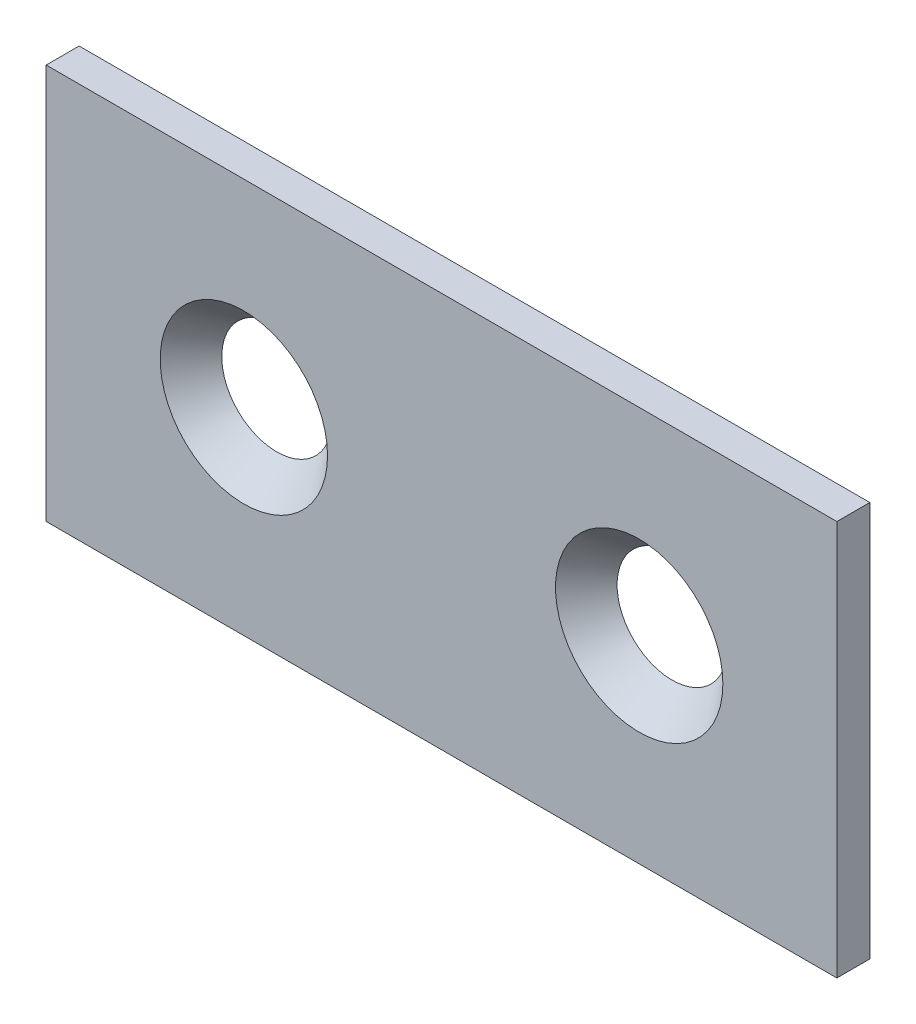
ISO-10303-21;
HEADER;
FILE_DESCRIPTION(('STEP AP214'),'2;1');
FILE_NAME('part.step','',(''),(''),'','','');
FILE_SCHEMA(('AUTOMOTIVE_DESIGN { 1 0 10303 214 1 1 1 1 }'));
ENDSEC;
DATA;
#1=APPLICATION_CONTEXT('core data for automotive mechanical design processes');
#2=APPLICATION_PROTOCOL_DEFINITION('international standard','automotive_design',2000,#1);
#3=PRODUCT_CONTEXT('',#1,'mechanical');
#4=PRODUCT('Part','Part','',(#3));
#5=PRODUCT_RELATED_PRODUCT_CATEGORY('part','',(#4));
#6=PRODUCT_DEFINITION_FORMATION('','',#4);
#7=PRODUCT_DEFINITION_CONTEXT('part definition',#1,'design');
#8=PRODUCT_DEFINITION('design','',#6,#7);
#9=PRODUCT_DEFINITION_SHAPE('','',#8);
#10=(LENGTH_UNIT() NAMED_UNIT(*) SI_UNIT(.MILLI.,.METRE.));
#11=(NAMED_UNIT(*) PLANE_ANGLE_UNIT() SI_UNIT($,.RADIAN.));
#12=(NAMED_UNIT(*) SI_UNIT($,.STERADIAN.) SOLID_ANGLE_UNIT());
#13=UNCERTAINTY_MEASURE_WITH_UNIT(LENGTH_MEASURE(1.E-05),#10,'distance_accuracy_value','');
#14=(GEOMETRIC_REPRESENTATION_CONTEXT(3) GLOBAL_UNCERTAINTY_ASSIGNED_CONTEXT((#13)) GLOBAL_UNIT_ASSIGNED_CONTEXT((#10,
#11,#12)) REPRESENTATION_CONTEXT('',''));
#15=CARTESIAN_POINT('',(0.,0.,0.));
#16=DIRECTION('',(0.,0.,1.));
#17=DIRECTION('',(1.,0.,0.));
#18=AXIS2_PLACEMENT_3D('',#15,#16,#17);
#19=CARTESIAN_POINT('',(38.1,19.05,-3.175));
#20=DIRECTION('',(1.,0.,0.));
#21=DIRECTION('',(0.,0.,-1.));
#22=AXIS2_PLACEMENT_3D('',#19,#20,#21);
#23=PLANE('',#22);
#24=DIRECTION('',(0.,1.,0.));
#25=VECTOR('',#24,1.);
#26=CARTESIAN_POINT('',(38.1,19.05,0.));
#27=LINE('',#26,#25);
#28=CARTESIAN_POINT('',(38.1,-19.05,0.));
#29=VERTEX_POINT('',#28);
#30=CARTESIAN_POINT('',(38.1,19.05,0.));
#31=VERTEX_POINT('',#30);
#32=EDGE_CURVE('E100',#29,#31,#27,.T.);
#33=ORIENTED_EDGE('',*,*,#32,.F.);
#34=DIRECTION('',(0.,0.,1.));
#35=VECTOR('',#34,1.);
#36=CARTESIAN_POINT('',(38.1,-19.05,-3.175));
#37=LINE('',#36,#35);
#38=CARTESIAN_POINT('',(38.1,-19.05,-3.175));
#39=VERTEX_POINT('',#38);
#40=EDGE_CURVE('E11',#39,#29,#37,.T.);
#41=ORIENTED_EDGE('',*,*,#40,.F.);
#42=DIRECTION('',(0.,1.,0.));
#43=VECTOR('',#42,1.);
#44=CARTESIAN_POINT('',(38.1,19.05,-3.175));
#45=LINE('',#44,#43);
#46=CARTESIAN_POINT('',(38.1,19.05,-3.175));
#47=VERTEX_POINT('',#46);
#48=EDGE_CURVE('E93',#39,#47,#45,.T.);
#49=ORIENTED_EDGE('',*,*,#48,.T.);
#50=DIRECTION('',(0.,0.,1.));
#51=VECTOR('',#50,1.);
#52=CARTESIAN_POINT('',(38.1,19.05,-3.175));
#53=LINE('',#52,#51);
#54=EDGE_CURVE('E38',#47,#31,#53,.T.);
#55=ORIENTED_EDGE('',*,*,#54,.T.);
#56=EDGE_LOOP('',(#33,#41,#49,#55));
#57=FACE_BOUND('',#56,.T.);
#58=ADVANCED_FACE('F35',(#57),#23,.T.);
#59=CARTESIAN_POINT('',(-38.1,-19.05,-3.175));
#60=DIRECTION('',(0.,-1.,0.));
#61=DIRECTION('',(1.,0.,0.));
#62=AXIS2_PLACEMENT_3D('',#59,#60,#61);
#63=PLANE('',#62);
#64=DIRECTION('',(1.,0.,0.));
#65=VECTOR('',#64,1.);
#66=CARTESIAN_POINT('',(-38.1,-19.05,0.));
#67=LINE('',#66,#65);
#68=CARTESIAN_POINT('',(-38.1,-19.05,0.));
#69=VERTEX_POINT('',#68);
#70=EDGE_CURVE('E95',#69,#29,#67,.T.);
#71=ORIENTED_EDGE('',*,*,#70,.F.);
#72=DIRECTION('',(0.,0.,1.));
#73=VECTOR('',#72,1.);
#74=CARTESIAN_POINT('',(-38.1,-19.05,-3.175));
#75=LINE('',#74,#73);
#76=CARTESIAN_POINT('',(-38.1,-19.05,-3.175));
#77=VERTEX_POINT('',#76);
#78=EDGE_CURVE('E44',#77,#69,#75,.T.);
#79=ORIENTED_EDGE('',*,*,#78,.F.);
#80=DIRECTION('',(1.,0.,0.));
#81=VECTOR('',#80,1.);
#82=CARTESIAN_POINT('',(-38.1,-19.05,-3.175));
#83=LINE('',#82,#81);
#84=EDGE_CURVE('E90',#77,#39,#83,.T.);
#85=ORIENTED_EDGE('',*,*,#84,.T.);
#86=ORIENTED_EDGE('',*,*,#40,.T.);
#87=EDGE_LOOP('',(#71,#79,#85,#86));
#88=FACE_BOUND('',#87,.T.);
#89=ADVANCED_FACE('F111',(#88),#63,.T.);
#90=CARTESIAN_POINT('',(-38.1,19.05,-3.175));
#91=DIRECTION('',(-1.,0.,0.));
#92=DIRECTION('',(0.,0.,1.));
#93=AXIS2_PLACEMENT_3D('',#90,#91,#92);
#94=PLANE('',#93);
#95=DIRECTION('',(0.,-1.,0.));
#96=VECTOR('',#95,1.);
#97=CARTESIAN_POINT('',(-38.1,19.05,0.));
#98=LINE('',#97,#96);
#99=CARTESIAN_POINT('',(-38.1,19.05,0.));
#100=VERTEX_POINT('',#99);
#101=EDGE_CURVE('E85',#100,#69,#98,.T.);
#102=ORIENTED_EDGE('',*,*,#101,.F.);
#103=DIRECTION('',(0.,0.,1.));
#104=VECTOR('',#103,1.);
#105=CARTESIAN_POINT('',(-38.1,19.05,-3.175));
#106=LINE('',#105,#104);
#107=CARTESIAN_POINT('',(-38.1,19.05,-3.175));
#108=VERTEX_POINT('',#107);
#109=EDGE_CURVE('E80',#108,#100,#106,.T.);
#110=ORIENTED_EDGE('',*,*,#109,.F.);
#111=DIRECTION('',(0.,-1.,0.));
#112=VECTOR('',#111,1.);
#113=CARTESIAN_POINT('',(-38.1,19.05,-3.175));
#114=LINE('',#113,#112);
#115=EDGE_CURVE('E83',#108,#77,#114,.T.);
#116=ORIENTED_EDGE('',*,*,#115,.T.);
#117=ORIENTED_EDGE('',*,*,#78,.T.);
#118=EDGE_LOOP('',(#102,#110,#116,#117));
#119=FACE_BOUND('',#118,.T.);
#120=ADVANCED_FACE('F82',(#119),#94,.T.);
#121=CARTESIAN_POINT('',(-38.1,19.05,-3.175));
#122=DIRECTION('',(0.,1.,0.));
#123=DIRECTION('',(0.,0.,1.));
#124=AXIS2_PLACEMENT_3D('',#121,#122,#123);
#125=PLANE('',#124);
#126=DIRECTION('',(-1.,0.,0.));
#127=VECTOR('',#126,1.);
#128=CARTESIAN_POINT('',(-38.1,19.05,0.));
#129=LINE('',#128,#127);
#130=EDGE_CURVE('E103',#31,#100,#129,.T.);
#131=ORIENTED_EDGE('',*,*,#130,.F.);
#132=ORIENTED_EDGE('',*,*,#54,.F.);
#133=DIRECTION('',(-1.,0.,0.));
#134=VECTOR('',#133,1.);
#135=CARTESIAN_POINT('',(-38.1,19.05,-3.175));
#136=LINE('',#135,#134);
#137=EDGE_CURVE('E89',#47,#108,#136,.T.);
#138=ORIENTED_EDGE('',*,*,#137,.T.);
#139=ORIENTED_EDGE('',*,*,#109,.T.);
#140=EDGE_LOOP('',(#131,#132,#138,#139));
#141=FACE_BOUND('',#140,.T.);
#142=ADVANCED_FACE('F92',(#141),#125,.T.);
#143=CARTESIAN_POINT('',(0.,0.,-3.175));
#144=DIRECTION('',(0.,0.,1.));
#145=DIRECTION('',(1.,0.,0.));
#146=AXIS2_PLACEMENT_3D('',#143,#144,#145);
#147=PLANE('',#146);
#148=CARTESIAN_POINT('',(-19.05,0.,-3.175));
#149=DIRECTION('',(0.,0.,1.));
#150=DIRECTION('',(1.,0.,0.));
#151=AXIS2_PLACEMENT_3D('',#148,#149,#150);
#152=CIRCLE('',#151,5.30451460743348);
#153=CARTESIAN_POINT('',(-13.7454853925665,0.,-3.175));
#154=VERTEX_POINT('',#153);
#155=EDGE_CURVE('E147',#154,#154,#152,.T.);
#156=ORIENTED_EDGE('',*,*,#155,.T.);
#157=EDGE_LOOP('',(#156));
#158=FACE_BOUND('',#157,.T.);
#159=CARTESIAN_POINT('',(19.05,0.,-3.175));
#160=DIRECTION('',(0.,0.,1.));
#161=DIRECTION('',(1.,0.,0.));
#162=AXIS2_PLACEMENT_3D('',#159,#160,#161);
#163=CIRCLE('',#162,5.30451460743348);
#164=CARTESIAN_POINT('',(24.3545146074335,0.,-3.175));
#165=VERTEX_POINT('',#164);
#166=EDGE_CURVE('E104',#165,#165,#163,.T.);
#167=ORIENTED_EDGE('',*,*,#166,.T.);
#168=EDGE_LOOP('',(#167));
#169=FACE_BOUND('',#168,.T.);
#170=ORIENTED_EDGE('',*,*,#48,.F.);
#171=ORIENTED_EDGE('',*,*,#84,.F.);
#172=ORIENTED_EDGE('',*,*,#115,.F.);
#173=ORIENTED_EDGE('',*,*,#137,.F.);
#174=EDGE_LOOP('',(#170,#171,#172,#173));
#175=FACE_BOUND('',#174,.T.);
#176=ADVANCED_FACE('F88',(#158,#169,#175),#147,.F.);
#177=CARTESIAN_POINT('',(0.,0.,0.));
#178=DIRECTION('',(0.,0.,1.));
#179=DIRECTION('',(1.,0.,0.));
#180=AXIS2_PLACEMENT_3D('',#177,#178,#179);
#181=PLANE('',#180);
#182=CARTESIAN_POINT('',(-19.05,0.,0.));
#183=DIRECTION('',(0.,0.,1.));
#184=DIRECTION('',(1.,0.,0.));
#185=AXIS2_PLACEMENT_3D('',#182,#183,#184);
#186=CIRCLE('',#185,8.0645);
#187=CARTESIAN_POINT('',(-10.9855,0.,0.));
#188=VERTEX_POINT('',#187);
#189=EDGE_CURVE('E145',#188,#188,#186,.T.);
#190=ORIENTED_EDGE('',*,*,#189,.F.);
#191=EDGE_LOOP('',(#190));
#192=FACE_BOUND('',#191,.T.);
#193=CARTESIAN_POINT('',(19.05,0.,0.));
#194=DIRECTION('',(0.,0.,1.));
#195=DIRECTION('',(1.,0.,0.));
#196=AXIS2_PLACEMENT_3D('',#193,#194,#195);
#197=CIRCLE('',#196,8.0645);
#198=CARTESIAN_POINT('',(27.1145,0.,0.));
#199=VERTEX_POINT('',#198);
#200=EDGE_CURVE('E148',#199,#199,#197,.T.);
#201=ORIENTED_EDGE('',*,*,#200,.F.);
#202=EDGE_LOOP('',(#201));
#203=FACE_BOUND('',#202,.T.);
#204=ORIENTED_EDGE('',*,*,#32,.T.);
#205=ORIENTED_EDGE('',*,*,#130,.T.);
#206=ORIENTED_EDGE('',*,*,#101,.T.);
#207=ORIENTED_EDGE('',*,*,#70,.T.);
#208=EDGE_LOOP('',(#204,#205,#206,#207));
#209=FACE_BOUND('',#208,.T.);
#210=ADVANCED_FACE('F110',(#192,#203,#209),#181,.T.);
#211=CARTESIAN_POINT('',(19.05,0.,0.));
#212=DIRECTION('',(0.,0.,1.));
#213=DIRECTION('',(1.,0.,0.));
#214=AXIS2_PLACEMENT_3D('',#211,#212,#213);
#215=CONICAL_SURFACE('',#214,8.0645,0.715584993317675);
#216=ORIENTED_EDGE('',*,*,#200,.T.);
#217=EDGE_LOOP('',(#216));
#218=FACE_BOUND('',#217,.T.);
#219=ORIENTED_EDGE('',*,*,#166,.F.);
#220=EDGE_LOOP('',(#219));
#221=FACE_BOUND('',#220,.T.);
#222=ADVANCED_FACE('F129',(#218,#221),#215,.F.);
#223=CARTESIAN_POINT('',(-19.05,0.,0.));
#224=DIRECTION('',(0.,0.,1.));
#225=DIRECTION('',(1.,0.,0.));
#226=AXIS2_PLACEMENT_3D('',#223,#224,#225);
#227=CONICAL_SURFACE('',#226,8.0645,0.715584993317676);
#228=ORIENTED_EDGE('',*,*,#189,.T.);
#229=EDGE_LOOP('',(#228));
#230=FACE_BOUND('',#229,.T.);
#231=ORIENTED_EDGE('',*,*,#155,.F.);
#232=EDGE_LOOP('',(#231));
#233=FACE_BOUND('',#232,.T.);
#234=ADVANCED_FACE('F136',(#230,#233),#227,.F.);
#235=CLOSED_SHELL('',(#58,#89,#120,#142,#176,#210,#222,#234));
#236=MANIFOLD_SOLID_BREP('B2',#235);
#237=ADVANCED_BREP_SHAPE_REPRESENTATION('',(#18,#236),#14);
#238=SHAPE_DEFINITION_REPRESENTATION(#9,#237);
ENDSEC;
END-ISO-10303-21;
